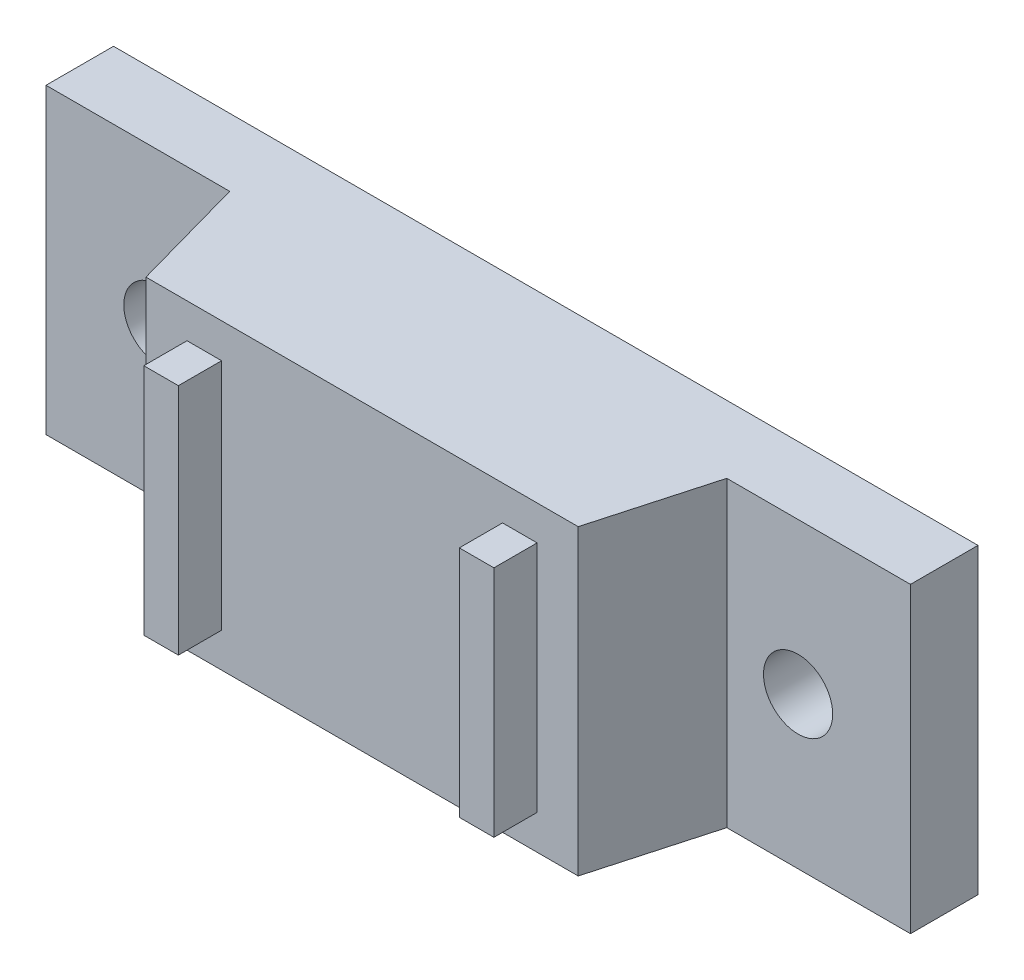
ISO-10303-21;
HEADER;
FILE_DESCRIPTION(('STEP AP214'),'2;1');
FILE_NAME('part.step','',(''),(''),'','','');
FILE_SCHEMA(('AUTOMOTIVE_DESIGN { 1 0 10303 214 1 1 1 1 }'));
ENDSEC;
DATA;
#1=APPLICATION_CONTEXT('core data for automotive mechanical design processes');
#2=APPLICATION_PROTOCOL_DEFINITION('international standard','automotive_design',2000,#1);
#3=PRODUCT_CONTEXT('',#1,'mechanical');
#4=PRODUCT('Part','Part','',(#3));
#5=PRODUCT_RELATED_PRODUCT_CATEGORY('part','',(#4));
#6=PRODUCT_DEFINITION_FORMATION('','',#4);
#7=PRODUCT_DEFINITION_CONTEXT('part definition',#1,'design');
#8=PRODUCT_DEFINITION('design','',#6,#7);
#9=PRODUCT_DEFINITION_SHAPE('','',#8);
#10=(LENGTH_UNIT() NAMED_UNIT(*) SI_UNIT(.MILLI.,.METRE.));
#11=(NAMED_UNIT(*) PLANE_ANGLE_UNIT() SI_UNIT($,.RADIAN.));
#12=(NAMED_UNIT(*) SI_UNIT($,.STERADIAN.) SOLID_ANGLE_UNIT());
#13=UNCERTAINTY_MEASURE_WITH_UNIT(LENGTH_MEASURE(1.E-05),#10,'distance_accuracy_value','');
#14=(GEOMETRIC_REPRESENTATION_CONTEXT(3) GLOBAL_UNCERTAINTY_ASSIGNED_CONTEXT((#13)) GLOBAL_UNIT_ASSIGNED_CONTEXT((#10,
#11,#12)) REPRESENTATION_CONTEXT('',''));
#15=CARTESIAN_POINT('',(0.,0.,0.));
#16=DIRECTION('',(0.,0.,1.));
#17=DIRECTION('',(1.,0.,0.));
#18=AXIS2_PLACEMENT_3D('',#15,#16,#17);
#19=CARTESIAN_POINT('',(-12.6999999999979,-8.89000000000306,10.795));
#20=DIRECTION('',(0.,0.,1.));
#21=DIRECTION('',(-2.4084900740462E-13,1.,0.));
#22=AXIS2_PLACEMENT_3D('',#19,#20,#21);
#23=PLANE('',#22);
#24=DIRECTION('',(-1.,-2.4084900740462E-13,0.));
#25=VECTOR('',#24,1.);
#26=CARTESIAN_POINT('',(-8.25500000000165,6.85799999999801,10.795));
#27=LINE('',#26,#25);
#28=CARTESIAN_POINT('',(-8.25500000000165,6.85799999999801,10.795));
#29=VERTEX_POINT('',#28);
#30=CARTESIAN_POINT('',(-10.2870000000017,6.85799999999752,10.795));
#31=VERTEX_POINT('',#30);
#32=EDGE_CURVE('E188',#29,#31,#27,.T.);
#33=ORIENTED_EDGE('',*,*,#32,.F.);
#34=DIRECTION('',(-2.40722532960469E-13,1.,0.));
#35=VECTOR('',#34,1.);
#36=CARTESIAN_POINT('',(-8.25499999999835,-6.85800000000199,10.795));
#37=LINE('',#36,#35);
#38=CARTESIAN_POINT('',(-8.25499999999835,-6.85800000000199,10.795));
#39=VERTEX_POINT('',#38);
#40=EDGE_CURVE('E185',#39,#29,#37,.T.);
#41=ORIENTED_EDGE('',*,*,#40,.F.);
#42=DIRECTION('',(1.,2.4042215615561E-13,0.));
#43=VECTOR('',#42,1.);
#44=CARTESIAN_POINT('',(-10.2869999999983,-6.85800000000248,10.795));
#45=LINE('',#44,#43);
#46=CARTESIAN_POINT('',(-10.2869999999983,-6.85800000000248,10.795));
#47=VERTEX_POINT('',#46);
#48=EDGE_CURVE('E197',#47,#39,#45,.T.);
#49=ORIENTED_EDGE('',*,*,#48,.F.);
#50=DIRECTION('',(2.4084900740462E-13,-1.,0.));
#51=VECTOR('',#50,1.);
#52=CARTESIAN_POINT('',(-10.2870000000017,6.85799999999752,10.795));
#53=LINE('',#52,#51);
#54=EDGE_CURVE('E205',#31,#47,#53,.T.);
#55=ORIENTED_EDGE('',*,*,#54,.F.);
#56=EDGE_LOOP('',(#33,#41,#49,#55));
#57=FACE_BOUND('',#56,.T.);
#58=DIRECTION('',(1.,2.4084900740462E-13,0.));
#59=VECTOR('',#58,1.);
#60=CARTESIAN_POINT('',(12.7000000000021,-8.88999999999694,10.795));
#61=LINE('',#60,#59);
#62=CARTESIAN_POINT('',(-12.6999999999979,-8.89000000000306,10.795));
#63=VERTEX_POINT('',#62);
#64=CARTESIAN_POINT('',(12.7000000000021,-8.88999999999694,10.795));
#65=VERTEX_POINT('',#64);
#66=EDGE_CURVE('E283',#63,#65,#61,.T.);
#67=ORIENTED_EDGE('',*,*,#66,.T.);
#68=DIRECTION('',(-2.4084900740462E-13,1.,0.));
#69=VECTOR('',#68,1.);
#70=CARTESIAN_POINT('',(12.6999999999979,8.89000000000306,10.795));
#71=LINE('',#70,#69);
#72=CARTESIAN_POINT('',(12.6999999999979,8.89000000000306,10.795));
#73=VERTEX_POINT('',#72);
#74=EDGE_CURVE('E221',#65,#73,#71,.T.);
#75=ORIENTED_EDGE('',*,*,#74,.T.);
#76=DIRECTION('',(-1.,-2.4084900740462E-13,0.));
#77=VECTOR('',#76,1.);
#78=CARTESIAN_POINT('',(12.6999999999979,8.89000000000306,10.795));
#79=LINE('',#78,#77);
#80=CARTESIAN_POINT('',(-12.7000000000021,8.88999999999694,10.795));
#81=VERTEX_POINT('',#80);
#82=EDGE_CURVE('E325',#73,#81,#79,.T.);
#83=ORIENTED_EDGE('',*,*,#82,.T.);
#84=DIRECTION('',(2.4084900740462E-13,-1.,0.));
#85=VECTOR('',#84,1.);
#86=CARTESIAN_POINT('',(-12.7000000000021,8.88999999999694,10.795));
#87=LINE('',#86,#85);
#88=EDGE_CURVE('E292',#81,#63,#87,.T.);
#89=ORIENTED_EDGE('',*,*,#88,.T.);
#90=EDGE_LOOP('',(#67,#75,#83,#89));
#91=FACE_BOUND('',#90,.T.);
#92=DIRECTION('',(1.,2.4084900740462E-13,0.));
#93=VECTOR('',#92,1.);
#94=CARTESIAN_POINT('',(8.25500000000165,-6.85799999999801,10.795));
#95=LINE('',#94,#93);
#96=CARTESIAN_POINT('',(8.25500000000165,-6.85799999999801,10.795));
#97=VERTEX_POINT('',#96);
#98=CARTESIAN_POINT('',(10.2870000000017,-6.85799999999752,10.795));
#99=VERTEX_POINT('',#98);
#100=EDGE_CURVE('E620',#97,#99,#95,.T.);
#101=ORIENTED_EDGE('',*,*,#100,.F.);
#102=DIRECTION('',(2.40975481848771E-13,-1.,0.));
#103=VECTOR('',#102,1.);
#104=CARTESIAN_POINT('',(8.25499999999835,6.85800000000199,10.795));
#105=LINE('',#104,#103);
#106=CARTESIAN_POINT('',(8.25499999999835,6.85800000000199,10.795));
#107=VERTEX_POINT('',#106);
#108=EDGE_CURVE('E183',#107,#97,#105,.T.);
#109=ORIENTED_EDGE('',*,*,#108,.F.);
#110=DIRECTION('',(-1.,-2.4084900740462E-13,0.));
#111=VECTOR('',#110,1.);
#112=CARTESIAN_POINT('',(10.2869999999983,6.85800000000248,10.795));
#113=LINE('',#112,#111);
#114=CARTESIAN_POINT('',(10.2869999999983,6.85800000000248,10.795));
#115=VERTEX_POINT('',#114);
#116=EDGE_CURVE('E179',#115,#107,#113,.T.);
#117=ORIENTED_EDGE('',*,*,#116,.F.);
#118=DIRECTION('',(-2.4084900740462E-13,1.,0.));
#119=VECTOR('',#118,1.);
#120=CARTESIAN_POINT('',(10.2870000000017,-6.85799999999752,10.795));
#121=LINE('',#120,#119);
#122=EDGE_CURVE('E617',#99,#115,#121,.T.);
#123=ORIENTED_EDGE('',*,*,#122,.F.);
#124=EDGE_LOOP('',(#101,#109,#117,#123));
#125=FACE_BOUND('',#124,.T.);
#126=ADVANCED_FACE('F42',(#57,#91,#125),#23,.T.);
#127=CARTESIAN_POINT('',(-25.3999999999979,-8.89000000000612,3.96875));
#128=DIRECTION('',(0.,0.,1.));
#129=DIRECTION('',(-2.4084900740462E-13,1.,0.));
#130=AXIS2_PLACEMENT_3D('',#127,#128,#129);
#131=PLANE('',#130);
#132=CARTESIAN_POINT('',(18.796,4.53185806068281E-12,3.96875));
#133=DIRECTION('',(0.,0.,1.));
#134=DIRECTION('',(-2.4084900740462E-13,1.,0.));
#135=AXIS2_PLACEMENT_3D('',#132,#133,#134);
#136=CIRCLE('',#135,2.032);
#137=CARTESIAN_POINT('',(18.7959999999995,2.03200000000453,3.96875));
#138=VERTEX_POINT('',#137);
#139=EDGE_CURVE('E364',#138,#138,#136,.T.);
#140=ORIENTED_EDGE('',*,*,#139,.F.);
#141=EDGE_LOOP('',(#140));
#142=FACE_BOUND('',#141,.T.);
#143=DIRECTION('',(-1.,-2.4084900740462E-13,0.));
#144=VECTOR('',#143,1.);
#145=CARTESIAN_POINT('',(25.3999999999979,8.89000000000612,3.96875));
#146=LINE('',#145,#144);
#147=CARTESIAN_POINT('',(25.3999999999979,8.89000000000612,3.96875));
#148=VERTEX_POINT('',#147);
#149=CARTESIAN_POINT('',(14.6049999999979,8.89000000000352,3.96875));
#150=VERTEX_POINT('',#149);
#151=EDGE_CURVE('E408',#148,#150,#146,.T.);
#152=ORIENTED_EDGE('',*,*,#151,.T.);
#153=DIRECTION('',(-2.4084900740462E-13,1.,0.));
#154=VECTOR('',#153,1.);
#155=CARTESIAN_POINT('',(14.6050000000021,-8.88999999999648,3.96875));
#156=LINE('',#155,#154);
#157=CARTESIAN_POINT('',(14.6050000000021,-8.88999999999648,3.96875));
#158=VERTEX_POINT('',#157);
#159=EDGE_CURVE('E427',#158,#150,#156,.T.);
#160=ORIENTED_EDGE('',*,*,#159,.F.);
#161=DIRECTION('',(1.,2.4084900740462E-13,0.));
#162=VECTOR('',#161,1.);
#163=CARTESIAN_POINT('',(25.4000000000021,-8.88999999999388,3.96875));
#164=LINE('',#163,#162);
#165=CARTESIAN_POINT('',(25.4000000000021,-8.88999999999388,3.96875));
#166=VERTEX_POINT('',#165);
#167=EDGE_CURVE('E387',#158,#166,#164,.T.);
#168=ORIENTED_EDGE('',*,*,#167,.T.);
#169=DIRECTION('',(-2.41044139404167E-13,1.,0.));
#170=VECTOR('',#169,1.);
#171=CARTESIAN_POINT('',(25.3999999999979,8.89000000000612,3.96875));
#172=LINE('',#171,#170);
#173=EDGE_CURVE('E383',#166,#148,#172,.T.);
#174=ORIENTED_EDGE('',*,*,#173,.T.);
#175=EDGE_LOOP('',(#152,#160,#168,#174));
#176=FACE_BOUND('',#175,.T.);
#177=ADVANCED_FACE('F252',(#142,#176),#131,.T.);
#178=CARTESIAN_POINT('',(-18.796,-4.53364705629004E-12,3.96875));
#179=DIRECTION('',(0.,0.,1.));
#180=DIRECTION('',(-2.4084900740462E-13,1.,0.));
#181=AXIS2_PLACEMENT_3D('',#178,#179,#180);
#182=CIRCLE('',#181,2.032);
#183=CARTESIAN_POINT('',(-18.7960000000005,2.03199999999547,3.96875));
#184=VERTEX_POINT('',#183);
#185=EDGE_CURVE('E375',#184,#184,#182,.T.);
#186=ORIENTED_EDGE('',*,*,#185,.F.);
#187=EDGE_LOOP('',(#186));
#188=FACE_BOUND('',#187,.T.);
#189=CARTESIAN_POINT('',(-25.3999999999979,-8.89000000000612,3.96875));
#190=VERTEX_POINT('',#189);
#191=CARTESIAN_POINT('',(-14.6049999999979,-8.89000000000352,3.96875));
#192=VERTEX_POINT('',#191);
#193=EDGE_CURVE('E390',#190,#192,#164,.T.);
#194=ORIENTED_EDGE('',*,*,#193,.T.);
#195=DIRECTION('',(2.4084900740462E-13,-1.,0.));
#196=VECTOR('',#195,1.);
#197=CARTESIAN_POINT('',(-14.6049999999979,-8.89000000000352,3.96875));
#198=LINE('',#197,#196);
#199=CARTESIAN_POINT('',(-14.6050000000021,8.88999999999648,3.96875));
#200=VERTEX_POINT('',#199);
#201=EDGE_CURVE('E216',#200,#192,#198,.T.);
#202=ORIENTED_EDGE('',*,*,#201,.F.);
#203=CARTESIAN_POINT('',(-25.4000000000021,8.88999999999388,3.96875));
#204=VERTEX_POINT('',#203);
#205=EDGE_CURVE('E412',#200,#204,#146,.T.);
#206=ORIENTED_EDGE('',*,*,#205,.T.);
#207=DIRECTION('',(2.41044139404167E-13,-1.,0.));
#208=VECTOR('',#207,1.);
#209=CARTESIAN_POINT('',(-25.4000000000021,8.88999999999388,3.96875));
#210=LINE('',#209,#208);
#211=EDGE_CURVE('E400',#204,#190,#210,.T.);
#212=ORIENTED_EDGE('',*,*,#211,.T.);
#213=EDGE_LOOP('',(#194,#202,#206,#212));
#214=FACE_BOUND('',#213,.T.);
#215=ADVANCED_FACE('F255',(#188,#214),#131,.T.);
#216=CARTESIAN_POINT('',(-25.3999999999979,-8.89000000000612,0.));
#217=DIRECTION('',(0.,0.,1.));
#218=DIRECTION('',(-2.4084900740462E-13,1.,0.));
#219=AXIS2_PLACEMENT_3D('',#216,#217,#218);
#220=PLANE('',#219);
#221=CARTESIAN_POINT('',(-18.796,-4.53364705629004E-12,0.));
#222=DIRECTION('',(0.,0.,1.));
#223=DIRECTION('',(-2.4084900740462E-13,1.,0.));
#224=AXIS2_PLACEMENT_3D('',#221,#222,#223);
#225=CIRCLE('',#224,2.032);
#226=CARTESIAN_POINT('',(-18.7960000000005,2.03199999999547,0.));
#227=VERTEX_POINT('',#226);
#228=EDGE_CURVE('E372',#227,#227,#225,.T.);
#229=ORIENTED_EDGE('',*,*,#228,.T.);
#230=EDGE_LOOP('',(#229));
#231=FACE_BOUND('',#230,.T.);
#232=DIRECTION('',(1.,2.4084900740462E-13,0.));
#233=VECTOR('',#232,1.);
#234=CARTESIAN_POINT('',(25.4000000000021,-8.88999999999388,0.));
#235=LINE('',#234,#233);
#236=CARTESIAN_POINT('',(-25.3999999999979,-8.89000000000612,0.));
#237=VERTEX_POINT('',#236);
#238=CARTESIAN_POINT('',(25.4000000000021,-8.88999999999388,0.));
#239=VERTEX_POINT('',#238);
#240=EDGE_CURVE('E378',#237,#239,#235,.T.);
#241=ORIENTED_EDGE('',*,*,#240,.F.);
#242=DIRECTION('',(2.41044139404167E-13,-1.,0.));
#243=VECTOR('',#242,1.);
#244=CARTESIAN_POINT('',(-25.4000000000021,8.88999999999388,0.));
#245=LINE('',#244,#243);
#246=CARTESIAN_POINT('',(-25.4000000000021,8.88999999999388,0.));
#247=VERTEX_POINT('',#246);
#248=EDGE_CURVE('E401',#247,#237,#245,.T.);
#249=ORIENTED_EDGE('',*,*,#248,.F.);
#250=DIRECTION('',(-1.,-2.4084900740462E-13,0.));
#251=VECTOR('',#250,1.);
#252=CARTESIAN_POINT('',(25.3999999999979,8.89000000000612,0.));
#253=LINE('',#252,#251);
#254=CARTESIAN_POINT('',(25.3999999999979,8.89000000000612,0.));
#255=VERTEX_POINT('',#254);
#256=EDGE_CURVE('E403',#255,#247,#253,.T.);
#257=ORIENTED_EDGE('',*,*,#256,.F.);
#258=DIRECTION('',(-2.41044139404167E-13,1.,0.));
#259=VECTOR('',#258,1.);
#260=CARTESIAN_POINT('',(25.3999999999979,8.89000000000612,0.));
#261=LINE('',#260,#259);
#262=EDGE_CURVE('E405',#239,#255,#261,.T.);
#263=ORIENTED_EDGE('',*,*,#262,.F.);
#264=EDGE_LOOP('',(#241,#249,#257,#263));
#265=FACE_BOUND('',#264,.T.);
#266=CARTESIAN_POINT('',(18.796,4.53185806068281E-12,0.));
#267=DIRECTION('',(0.,0.,1.));
#268=DIRECTION('',(-2.4084900740462E-13,1.,0.));
#269=AXIS2_PLACEMENT_3D('',#266,#267,#268);
#270=CIRCLE('',#269,2.032);
#271=CARTESIAN_POINT('',(18.7959999999995,2.03200000000453,0.));
#272=VERTEX_POINT('',#271);
#273=EDGE_CURVE('E324',#272,#272,#270,.T.);
#274=ORIENTED_EDGE('',*,*,#273,.T.);
#275=EDGE_LOOP('',(#274));
#276=FACE_BOUND('',#275,.T.);
#277=ADVANCED_FACE('F257',(#231,#265,#276),#220,.F.);
#278=CARTESIAN_POINT('',(25.4000000000021,-8.88999999999388,3.96875));
#279=DIRECTION('',(-2.4084900740462E-13,1.,0.));
#280=DIRECTION('',(0.,0.,-1.));
#281=AXIS2_PLACEMENT_3D('',#278,#279,#280);
#282=PLANE('',#281);
#283=ORIENTED_EDGE('',*,*,#240,.T.);
#284=DIRECTION('',(0.,0.,-1.));
#285=VECTOR('',#284,1.);
#286=CARTESIAN_POINT('',(25.4000000000021,-8.88999999999388,3.96875));
#287=LINE('',#286,#285);
#288=EDGE_CURVE('E12',#166,#239,#287,.T.);
#289=ORIENTED_EDGE('',*,*,#288,.F.);
#290=ORIENTED_EDGE('',*,*,#167,.F.);
#291=DIRECTION('',(0.268798967813945,0.,-0.963196301333304));
#292=VECTOR('',#291,1.);
#293=CARTESIAN_POINT('',(12.7000000000021,-8.88999999999694,10.795));
#294=LINE('',#293,#292);
#295=EDGE_CURVE('E227',#65,#158,#294,.T.);
#296=ORIENTED_EDGE('',*,*,#295,.F.);
#297=ORIENTED_EDGE('',*,*,#66,.F.);
#298=DIRECTION('',(-0.268798967813945,0.,-0.963196301333304));
#299=VECTOR('',#298,1.);
#300=CARTESIAN_POINT('',(-12.6999999999979,-8.89000000000306,10.795));
#301=LINE('',#300,#299);
#302=EDGE_CURVE('E287',#63,#192,#301,.T.);
#303=ORIENTED_EDGE('',*,*,#302,.T.);
#304=ORIENTED_EDGE('',*,*,#193,.F.);
#305=DIRECTION('',(0.,0.,-1.));
#306=VECTOR('',#305,1.);
#307=CARTESIAN_POINT('',(-25.3999999999979,-8.89000000000612,3.96875));
#308=LINE('',#307,#306);
#309=EDGE_CURVE('E397',#190,#237,#308,.T.);
#310=ORIENTED_EDGE('',*,*,#309,.T.);
#311=EDGE_LOOP('',(#283,#289,#290,#296,#297,#303,#304,#310));
#312=FACE_BOUND('',#311,.T.);
#313=ADVANCED_FACE('F44',(#312),#282,.F.);
#314=CARTESIAN_POINT('',(25.3999999999979,8.89000000000612,3.96875));
#315=DIRECTION('',(-1.,-2.41044139404167E-13,0.));
#316=DIRECTION('',(2.41044139404167E-13,-1.,0.));
#317=AXIS2_PLACEMENT_3D('',#314,#315,#316);
#318=PLANE('',#317);
#319=ORIENTED_EDGE('',*,*,#262,.T.);
#320=DIRECTION('',(0.,0.,-1.));
#321=VECTOR('',#320,1.);
#322=CARTESIAN_POINT('',(25.3999999999979,8.89000000000612,3.96875));
#323=LINE('',#322,#321);
#324=EDGE_CURVE('E53',#148,#255,#323,.T.);
#325=ORIENTED_EDGE('',*,*,#324,.F.);
#326=ORIENTED_EDGE('',*,*,#173,.F.);
#327=ORIENTED_EDGE('',*,*,#288,.T.);
#328=EDGE_LOOP('',(#319,#325,#326,#327));
#329=FACE_BOUND('',#328,.T.);
#330=ADVANCED_FACE('F267',(#329),#318,.F.);
#331=CARTESIAN_POINT('',(25.3999999999979,8.89000000000612,3.96875));
#332=DIRECTION('',(2.4084900740462E-13,-1.,0.));
#333=DIRECTION('',(0.,0.,1.));
#334=AXIS2_PLACEMENT_3D('',#331,#332,#333);
#335=PLANE('',#334);
#336=ORIENTED_EDGE('',*,*,#256,.T.);
#337=DIRECTION('',(0.,0.,-1.));
#338=VECTOR('',#337,1.);
#339=CARTESIAN_POINT('',(-25.4000000000021,8.88999999999388,3.96875));
#340=LINE('',#339,#338);
#341=EDGE_CURVE('E394',#204,#247,#340,.T.);
#342=ORIENTED_EDGE('',*,*,#341,.F.);
#343=ORIENTED_EDGE('',*,*,#205,.F.);
#344=DIRECTION('',(-0.268798967813945,0.,-0.963196301333304));
#345=VECTOR('',#344,1.);
#346=CARTESIAN_POINT('',(-12.7000000000021,8.88999999999694,10.795));
#347=LINE('',#346,#345);
#348=EDGE_CURVE('E299',#81,#200,#347,.T.);
#349=ORIENTED_EDGE('',*,*,#348,.F.);
#350=ORIENTED_EDGE('',*,*,#82,.F.);
#351=DIRECTION('',(0.268798967813945,0.,-0.963196301333304));
#352=VECTOR('',#351,1.);
#353=CARTESIAN_POINT('',(12.6999999999979,8.89000000000306,10.795));
#354=LINE('',#353,#352);
#355=EDGE_CURVE('E301',#73,#150,#354,.T.);
#356=ORIENTED_EDGE('',*,*,#355,.T.);
#357=ORIENTED_EDGE('',*,*,#151,.F.);
#358=ORIENTED_EDGE('',*,*,#324,.T.);
#359=EDGE_LOOP('',(#336,#342,#343,#349,#350,#356,#357,#358));
#360=FACE_BOUND('',#359,.T.);
#361=ADVANCED_FACE('F263',(#360),#335,.F.);
#362=CARTESIAN_POINT('',(-25.4000000000021,8.88999999999388,3.96875));
#363=DIRECTION('',(1.,2.41044139404167E-13,0.));
#364=DIRECTION('',(-2.41044139404167E-13,1.,0.));
#365=AXIS2_PLACEMENT_3D('',#362,#363,#364);
#366=PLANE('',#365);
#367=ORIENTED_EDGE('',*,*,#248,.T.);
#368=ORIENTED_EDGE('',*,*,#309,.F.);
#369=ORIENTED_EDGE('',*,*,#211,.F.);
#370=ORIENTED_EDGE('',*,*,#341,.T.);
#371=EDGE_LOOP('',(#367,#368,#369,#370));
#372=FACE_BOUND('',#371,.T.);
#373=ADVANCED_FACE('F250',(#372),#366,.F.);
#374=CARTESIAN_POINT('',(-18.796,-4.53364705629004E-12,3.96875));
#375=DIRECTION('',(0.,0.,-1.));
#376=DIRECTION('',(2.4084900740462E-13,-1.,0.));
#377=AXIS2_PLACEMENT_3D('',#374,#375,#376);
#378=CYLINDRICAL_SURFACE('',#377,2.032);
#379=ORIENTED_EDGE('',*,*,#185,.T.);
#380=EDGE_LOOP('',(#379));
#381=FACE_BOUND('',#380,.T.);
#382=ORIENTED_EDGE('',*,*,#228,.F.);
#383=EDGE_LOOP('',(#382));
#384=FACE_BOUND('',#383,.T.);
#385=ADVANCED_FACE('F246',(#381,#384),#378,.F.);
#386=CARTESIAN_POINT('',(18.796,4.53185806068281E-12,3.96875));
#387=DIRECTION('',(0.,0.,-1.));
#388=DIRECTION('',(2.4084900740462E-13,-1.,0.));
#389=AXIS2_PLACEMENT_3D('',#386,#387,#388);
#390=CYLINDRICAL_SURFACE('',#389,2.032);
#391=ORIENTED_EDGE('',*,*,#139,.T.);
#392=EDGE_LOOP('',(#391));
#393=FACE_BOUND('',#392,.T.);
#394=ORIENTED_EDGE('',*,*,#273,.F.);
#395=EDGE_LOOP('',(#394));
#396=FACE_BOUND('',#395,.T.);
#397=ADVANCED_FACE('F241',(#393,#396),#390,.F.);
#398=CARTESIAN_POINT('',(-14.6050000000021,8.88999999999647,3.96875));
#399=DIRECTION('',(-0.963196301333304,-2.31984873111928E-13,0.268798967813945));
#400=DIRECTION('',(0.268798967813945,0.,0.963196301333304));
#401=AXIS2_PLACEMENT_3D('',#398,#399,#400);
#402=PLANE('',#401);
#403=ORIENTED_EDGE('',*,*,#348,.T.);
#404=ORIENTED_EDGE('',*,*,#201,.T.);
#405=ORIENTED_EDGE('',*,*,#302,.F.);
#406=ORIENTED_EDGE('',*,*,#88,.F.);
#407=EDGE_LOOP('',(#403,#404,#405,#406));
#408=FACE_BOUND('',#407,.T.);
#409=ADVANCED_FACE('F240',(#408),#402,.T.);
#410=CARTESIAN_POINT('',(14.6050000000021,-8.88999999999648,3.96875));
#411=DIRECTION('',(0.963196301333304,2.31984873111928E-13,0.268798967813945));
#412=DIRECTION('',(0.268798967813945,0.,-0.963196301333304));
#413=AXIS2_PLACEMENT_3D('',#410,#411,#412);
#414=PLANE('',#413);
#415=ORIENTED_EDGE('',*,*,#295,.T.);
#416=ORIENTED_EDGE('',*,*,#159,.T.);
#417=ORIENTED_EDGE('',*,*,#355,.F.);
#418=ORIENTED_EDGE('',*,*,#74,.F.);
#419=EDGE_LOOP('',(#415,#416,#417,#418));
#420=FACE_BOUND('',#419,.T.);
#421=ADVANCED_FACE('F229',(#420),#414,.T.);
#422=CARTESIAN_POINT('',(-8.25499999999835,-6.85800000000199,13.335));
#423=DIRECTION('',(-1.,-2.40722532960469E-13,0.));
#424=DIRECTION('',(2.40722532960469E-13,-1.,0.));
#425=AXIS2_PLACEMENT_3D('',#422,#423,#424);
#426=PLANE('',#425);
#427=ORIENTED_EDGE('',*,*,#40,.T.);
#428=DIRECTION('',(0.,0.,-1.));
#429=VECTOR('',#428,1.);
#430=CARTESIAN_POINT('',(-8.25500000000165,6.85799999999801,13.335));
#431=LINE('',#430,#429);
#432=CARTESIAN_POINT('',(-8.25500000000165,6.85799999999801,13.335));
#433=VERTEX_POINT('',#432);
#434=EDGE_CURVE('E214',#433,#29,#431,.T.);
#435=ORIENTED_EDGE('',*,*,#434,.F.);
#436=DIRECTION('',(-2.40722532960469E-13,1.,0.));
#437=VECTOR('',#436,1.);
#438=CARTESIAN_POINT('',(-8.25499999999835,-6.85800000000199,13.335));
#439=LINE('',#438,#437);
#440=CARTESIAN_POINT('',(-8.25499999999835,-6.85800000000199,13.335));
#441=VERTEX_POINT('',#440);
#442=EDGE_CURVE('E193',#441,#433,#439,.T.);
#443=ORIENTED_EDGE('',*,*,#442,.F.);
#444=DIRECTION('',(0.,0.,-1.));
#445=VECTOR('',#444,1.);
#446=CARTESIAN_POINT('',(-8.25499999999835,-6.85800000000199,13.335));
#447=LINE('',#446,#445);
#448=EDGE_CURVE('E202',#441,#39,#447,.T.);
#449=ORIENTED_EDGE('',*,*,#448,.T.);
#450=EDGE_LOOP('',(#427,#435,#443,#449));
#451=FACE_BOUND('',#450,.T.);
#452=ADVANCED_FACE('F239',(#451),#426,.F.);
#453=CARTESIAN_POINT('',(-8.25500000000165,6.85799999999801,13.335));
#454=DIRECTION('',(2.4084900740462E-13,-1.,0.));
#455=DIRECTION('',(0.,0.,1.));
#456=AXIS2_PLACEMENT_3D('',#453,#454,#455);
#457=PLANE('',#456);
#458=ORIENTED_EDGE('',*,*,#32,.T.);
#459=DIRECTION('',(0.,0.,-1.));
#460=VECTOR('',#459,1.);
#461=CARTESIAN_POINT('',(-10.2870000000017,6.85799999999752,13.335));
#462=LINE('',#461,#460);
#463=CARTESIAN_POINT('',(-10.2870000000017,6.85799999999752,13.335));
#464=VERTEX_POINT('',#463);
#465=EDGE_CURVE('E211',#464,#31,#462,.T.);
#466=ORIENTED_EDGE('',*,*,#465,.F.);
#467=DIRECTION('',(-1.,-2.4084900740462E-13,0.));
#468=VECTOR('',#467,1.);
#469=CARTESIAN_POINT('',(-8.25500000000165,6.85799999999801,13.335));
#470=LINE('',#469,#468);
#471=EDGE_CURVE('E196',#433,#464,#470,.T.);
#472=ORIENTED_EDGE('',*,*,#471,.F.);
#473=ORIENTED_EDGE('',*,*,#434,.T.);
#474=EDGE_LOOP('',(#458,#466,#472,#473));
#475=FACE_BOUND('',#474,.T.);
#476=ADVANCED_FACE('F492',(#475),#457,.F.);
#477=CARTESIAN_POINT('',(-10.2870000000017,6.85799999999752,13.335));
#478=DIRECTION('',(1.,2.4084900740462E-13,0.));
#479=DIRECTION('',(0.,0.,-1.));
#480=AXIS2_PLACEMENT_3D('',#477,#478,#479);
#481=PLANE('',#480);
#482=ORIENTED_EDGE('',*,*,#54,.T.);
#483=DIRECTION('',(0.,0.,-1.));
#484=VECTOR('',#483,1.);
#485=CARTESIAN_POINT('',(-10.2869999999983,-6.85800000000248,13.335));
#486=LINE('',#485,#484);
#487=CARTESIAN_POINT('',(-10.2869999999983,-6.85800000000248,13.335));
#488=VERTEX_POINT('',#487);
#489=EDGE_CURVE('E69',#488,#47,#486,.T.);
#490=ORIENTED_EDGE('',*,*,#489,.F.);
#491=DIRECTION('',(2.4084900740462E-13,-1.,0.));
#492=VECTOR('',#491,1.);
#493=CARTESIAN_POINT('',(-10.2870000000017,6.85799999999752,13.335));
#494=LINE('',#493,#492);
#495=EDGE_CURVE('E199',#464,#488,#494,.T.);
#496=ORIENTED_EDGE('',*,*,#495,.F.);
#497=ORIENTED_EDGE('',*,*,#465,.T.);
#498=EDGE_LOOP('',(#482,#490,#496,#497));
#499=FACE_BOUND('',#498,.T.);
#500=ADVANCED_FACE('F499',(#499),#481,.F.);
#501=CARTESIAN_POINT('',(-10.2869999999983,-6.85800000000248,13.335));
#502=DIRECTION('',(-2.4042215615561E-13,1.,0.));
#503=DIRECTION('',(-1.,-2.4042215615561E-13,0.));
#504=AXIS2_PLACEMENT_3D('',#501,#502,#503);
#505=PLANE('',#504);
#506=ORIENTED_EDGE('',*,*,#48,.T.);
#507=ORIENTED_EDGE('',*,*,#448,.F.);
#508=DIRECTION('',(1.,2.4042215615561E-13,0.));
#509=VECTOR('',#508,1.);
#510=CARTESIAN_POINT('',(-10.2869999999983,-6.85800000000248,13.335));
#511=LINE('',#510,#509);
#512=EDGE_CURVE('E201',#488,#441,#511,.T.);
#513=ORIENTED_EDGE('',*,*,#512,.F.);
#514=ORIENTED_EDGE('',*,*,#489,.T.);
#515=EDGE_LOOP('',(#506,#507,#513,#514));
#516=FACE_BOUND('',#515,.T.);
#517=ADVANCED_FACE('F506',(#516),#505,.F.);
#518=CARTESIAN_POINT('',(-8.25500000000165,6.85799999999801,13.335));
#519=DIRECTION('',(0.,0.,1.));
#520=DIRECTION('',(-2.4084900740462E-13,1.,0.));
#521=AXIS2_PLACEMENT_3D('',#518,#519,#520);
#522=PLANE('',#521);
#523=ORIENTED_EDGE('',*,*,#442,.T.);
#524=ORIENTED_EDGE('',*,*,#471,.T.);
#525=ORIENTED_EDGE('',*,*,#495,.T.);
#526=ORIENTED_EDGE('',*,*,#512,.T.);
#527=EDGE_LOOP('',(#523,#524,#525,#526));
#528=FACE_BOUND('',#527,.T.);
#529=ADVANCED_FACE('F514',(#528),#522,.T.);
#530=CARTESIAN_POINT('',(8.25499999999835,6.85800000000199,13.335));
#531=DIRECTION('',(1.,2.40975481848771E-13,0.));
#532=DIRECTION('',(-2.40975481848771E-13,1.,0.));
#533=AXIS2_PLACEMENT_3D('',#530,#531,#532);
#534=PLANE('',#533);
#535=ORIENTED_EDGE('',*,*,#108,.T.);
#536=DIRECTION('',(0.,0.,-1.));
#537=VECTOR('',#536,1.);
#538=CARTESIAN_POINT('',(8.25500000000165,-6.85799999999801,13.335));
#539=LINE('',#538,#537);
#540=CARTESIAN_POINT('',(8.25500000000165,-6.85799999999801,13.335));
#541=VERTEX_POINT('',#540);
#542=EDGE_CURVE('E164',#541,#97,#539,.T.);
#543=ORIENTED_EDGE('',*,*,#542,.F.);
#544=DIRECTION('',(2.40975481848771E-13,-1.,0.));
#545=VECTOR('',#544,1.);
#546=CARTESIAN_POINT('',(8.25499999999835,6.85800000000199,13.335));
#547=LINE('',#546,#545);
#548=CARTESIAN_POINT('',(8.25499999999835,6.85800000000199,13.335));
#549=VERTEX_POINT('',#548);
#550=EDGE_CURVE('E171',#549,#541,#547,.T.);
#551=ORIENTED_EDGE('',*,*,#550,.F.);
#552=DIRECTION('',(0.,0.,-1.));
#553=VECTOR('',#552,1.);
#554=CARTESIAN_POINT('',(8.25499999999835,6.85800000000199,13.335));
#555=LINE('',#554,#553);
#556=EDGE_CURVE('E614',#549,#107,#555,.T.);
#557=ORIENTED_EDGE('',*,*,#556,.T.);
#558=EDGE_LOOP('',(#535,#543,#551,#557));
#559=FACE_BOUND('',#558,.T.);
#560=ADVANCED_FACE('F181',(#559),#534,.F.);
#561=CARTESIAN_POINT('',(8.25500000000165,-6.85799999999801,13.335));
#562=DIRECTION('',(-2.4084900740462E-13,1.,0.));
#563=DIRECTION('',(0.,0.,-1.));
#564=AXIS2_PLACEMENT_3D('',#561,#562,#563);
#565=PLANE('',#564);
#566=ORIENTED_EDGE('',*,*,#100,.T.);
#567=DIRECTION('',(0.,0.,-1.));
#568=VECTOR('',#567,1.);
#569=CARTESIAN_POINT('',(10.2870000000017,-6.85799999999752,13.335));
#570=LINE('',#569,#568);
#571=CARTESIAN_POINT('',(10.2870000000017,-6.85799999999752,13.335));
#572=VERTEX_POINT('',#571);
#573=EDGE_CURVE('E167',#572,#99,#570,.T.);
#574=ORIENTED_EDGE('',*,*,#573,.F.);
#575=DIRECTION('',(1.,2.4084900740462E-13,0.));
#576=VECTOR('',#575,1.);
#577=CARTESIAN_POINT('',(8.25500000000165,-6.85799999999801,13.335));
#578=LINE('',#577,#576);
#579=EDGE_CURVE('E160',#541,#572,#578,.T.);
#580=ORIENTED_EDGE('',*,*,#579,.F.);
#581=ORIENTED_EDGE('',*,*,#542,.T.);
#582=EDGE_LOOP('',(#566,#574,#580,#581));
#583=FACE_BOUND('',#582,.T.);
#584=ADVANCED_FACE('F162',(#583),#565,.F.);
#585=CARTESIAN_POINT('',(10.2870000000017,-6.85799999999752,13.335));
#586=DIRECTION('',(-1.,-2.4084900740462E-13,0.));
#587=DIRECTION('',(0.,0.,1.));
#588=AXIS2_PLACEMENT_3D('',#585,#586,#587);
#589=PLANE('',#588);
#590=ORIENTED_EDGE('',*,*,#122,.T.);
#591=DIRECTION('',(0.,0.,-1.));
#592=VECTOR('',#591,1.);
#593=CARTESIAN_POINT('',(10.2869999999983,6.85800000000248,13.335));
#594=LINE('',#593,#592);
#595=CARTESIAN_POINT('',(10.2869999999983,6.85800000000248,13.335));
#596=VERTEX_POINT('',#595);
#597=EDGE_CURVE('E61',#596,#115,#594,.T.);
#598=ORIENTED_EDGE('',*,*,#597,.F.);
#599=DIRECTION('',(-2.4084900740462E-13,1.,0.));
#600=VECTOR('',#599,1.);
#601=CARTESIAN_POINT('',(10.2870000000017,-6.85799999999752,13.335));
#602=LINE('',#601,#600);
#603=EDGE_CURVE('E170',#572,#596,#602,.T.);
#604=ORIENTED_EDGE('',*,*,#603,.F.);
#605=ORIENTED_EDGE('',*,*,#573,.T.);
#606=EDGE_LOOP('',(#590,#598,#604,#605));
#607=FACE_BOUND('',#606,.T.);
#608=ADVANCED_FACE('F534',(#607),#589,.F.);
#609=CARTESIAN_POINT('',(10.2869999999983,6.85800000000248,13.335));
#610=DIRECTION('',(2.4084900740462E-13,-1.,0.));
#611=DIRECTION('',(0.,0.,1.));
#612=AXIS2_PLACEMENT_3D('',#609,#610,#611);
#613=PLANE('',#612);
#614=ORIENTED_EDGE('',*,*,#116,.T.);
#615=ORIENTED_EDGE('',*,*,#556,.F.);
#616=DIRECTION('',(-1.,-2.4084900740462E-13,0.));
#617=VECTOR('',#616,1.);
#618=CARTESIAN_POINT('',(10.2869999999983,6.85800000000248,13.335));
#619=LINE('',#618,#617);
#620=EDGE_CURVE('E175',#596,#549,#619,.T.);
#621=ORIENTED_EDGE('',*,*,#620,.F.);
#622=ORIENTED_EDGE('',*,*,#597,.T.);
#623=EDGE_LOOP('',(#614,#615,#621,#622));
#624=FACE_BOUND('',#623,.T.);
#625=ADVANCED_FACE('F541',(#624),#613,.F.);
#626=CARTESIAN_POINT('',(8.25500000000165,-6.85799999999801,13.335));
#627=DIRECTION('',(0.,0.,1.));
#628=DIRECTION('',(-2.4084900740462E-13,1.,0.));
#629=AXIS2_PLACEMENT_3D('',#626,#627,#628);
#630=PLANE('',#629);
#631=ORIENTED_EDGE('',*,*,#550,.T.);
#632=ORIENTED_EDGE('',*,*,#579,.T.);
#633=ORIENTED_EDGE('',*,*,#603,.T.);
#634=ORIENTED_EDGE('',*,*,#620,.T.);
#635=EDGE_LOOP('',(#631,#632,#633,#634));
#636=FACE_BOUND('',#635,.T.);
#637=ADVANCED_FACE('F174',(#636),#630,.T.);
#638=CLOSED_SHELL('',(#126,#177,#215,#277,#313,#330,#361,#373,#385,#397,#409,#421,#452,#476,
#500,#517,#529,#560,#584,#608,#625,#637));
#639=MANIFOLD_SOLID_BREP('B2',#638);
#640=ADVANCED_BREP_SHAPE_REPRESENTATION('',(#18,#639),#14);
#641=SHAPE_DEFINITION_REPRESENTATION(#9,#640);
ENDSEC;
END-ISO-10303-21;
